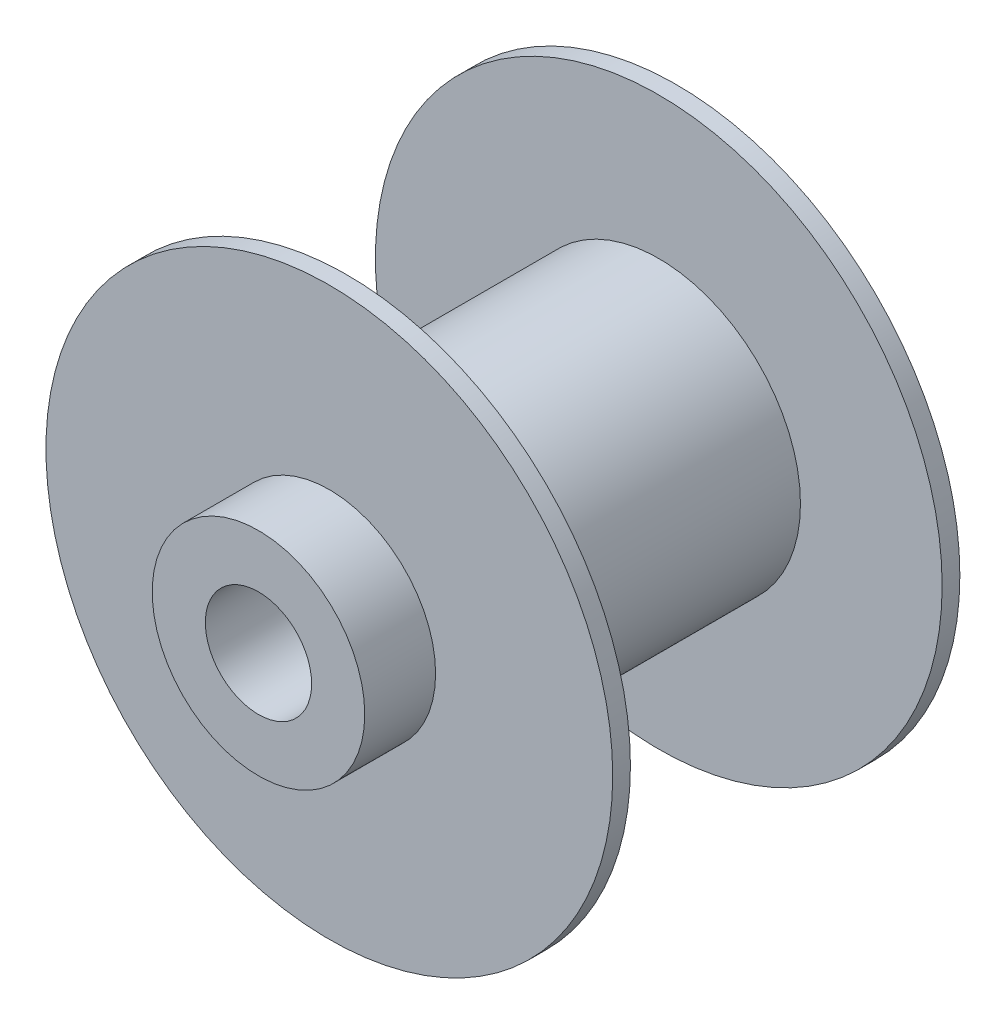
ISO-10303-21;
HEADER;
FILE_DESCRIPTION(('STEP AP214'),'2;1');
FILE_NAME('part.step','',(''),(''),'','','');
FILE_SCHEMA(('AUTOMOTIVE_DESIGN { 1 0 10303 214 1 1 1 1 }'));
ENDSEC;
DATA;
#1=APPLICATION_CONTEXT('core data for automotive mechanical design processes');
#2=APPLICATION_PROTOCOL_DEFINITION('international standard','automotive_design',2000,#1);
#3=PRODUCT_CONTEXT('',#1,'mechanical');
#4=PRODUCT('Part','Part','',(#3));
#5=PRODUCT_RELATED_PRODUCT_CATEGORY('part','',(#4));
#6=PRODUCT_DEFINITION_FORMATION('','',#4);
#7=PRODUCT_DEFINITION_CONTEXT('part definition',#1,'design');
#8=PRODUCT_DEFINITION('design','',#6,#7);
#9=PRODUCT_DEFINITION_SHAPE('','',#8);
#10=(LENGTH_UNIT() NAMED_UNIT(*) SI_UNIT(.MILLI.,.METRE.));
#11=(NAMED_UNIT(*) PLANE_ANGLE_UNIT() SI_UNIT($,.RADIAN.));
#12=(NAMED_UNIT(*) SI_UNIT($,.STERADIAN.) SOLID_ANGLE_UNIT());
#13=UNCERTAINTY_MEASURE_WITH_UNIT(LENGTH_MEASURE(1.E-05),#10,'distance_accuracy_value','');
#14=(GEOMETRIC_REPRESENTATION_CONTEXT(3) GLOBAL_UNCERTAINTY_ASSIGNED_CONTEXT((#13)) GLOBAL_UNIT_ASSIGNED_CONTEXT((#10,
#11,#12)) REPRESENTATION_CONTEXT('',''));
#15=CARTESIAN_POINT('',(0.,0.,0.));
#16=DIRECTION('',(0.,0.,1.));
#17=DIRECTION('',(1.,0.,0.));
#18=AXIS2_PLACEMENT_3D('',#15,#16,#17);
#19=CARTESIAN_POINT('',(0.,0.,3.175));
#20=DIRECTION('',(0.,0.,-1.));
#21=DIRECTION('',(-1.,0.,0.));
#22=AXIS2_PLACEMENT_3D('',#19,#20,#21);
#23=CYLINDRICAL_SURFACE('',#22,50.8);
#24=CARTESIAN_POINT('',(0.,0.,3.175));
#25=DIRECTION('',(0.,0.,1.));
#26=DIRECTION('',(1.,0.,0.));
#27=AXIS2_PLACEMENT_3D('',#24,#25,#26);
#28=CIRCLE('',#27,50.8);
#29=CARTESIAN_POINT('',(50.8,0.,3.175));
#30=VERTEX_POINT('',#29);
#31=EDGE_CURVE('E56',#30,#30,#28,.T.);
#32=ORIENTED_EDGE('',*,*,#31,.F.);
#33=EDGE_LOOP('',(#32));
#34=FACE_BOUND('',#33,.T.);
#35=CARTESIAN_POINT('',(0.,0.,0.));
#36=DIRECTION('',(0.,0.,1.));
#37=DIRECTION('',(1.,0.,0.));
#38=AXIS2_PLACEMENT_3D('',#35,#36,#37);
#39=CIRCLE('',#38,50.8);
#40=CARTESIAN_POINT('',(50.8,0.,0.));
#41=VERTEX_POINT('',#40);
#42=EDGE_CURVE('E47',#41,#41,#39,.T.);
#43=ORIENTED_EDGE('',*,*,#42,.T.);
#44=EDGE_LOOP('',(#43));
#45=FACE_BOUND('',#44,.T.);
#46=ADVANCED_FACE('F44',(#34,#45),#23,.T.);
#47=CARTESIAN_POINT('',(0.,0.,3.175));
#48=DIRECTION('',(0.,0.,1.));
#49=DIRECTION('',(1.,0.,0.));
#50=AXIS2_PLACEMENT_3D('',#47,#48,#49);
#51=PLANE('',#50);
#52=CARTESIAN_POINT('',(0.,0.,3.175));
#53=DIRECTION('',(0.,0.,1.));
#54=DIRECTION('',(1.,0.,0.));
#55=AXIS2_PLACEMENT_3D('',#52,#53,#54);
#56=CIRCLE('',#55,25.4);
#57=CARTESIAN_POINT('',(25.4,0.,3.175));
#58=VERTEX_POINT('',#57);
#59=EDGE_CURVE('E74',#58,#58,#56,.F.);
#60=ORIENTED_EDGE('',*,*,#59,.T.);
#61=EDGE_LOOP('',(#60));
#62=FACE_BOUND('',#61,.T.);
#63=ORIENTED_EDGE('',*,*,#31,.T.);
#64=EDGE_LOOP('',(#63));
#65=FACE_BOUND('',#64,.T.);
#66=ADVANCED_FACE('F86',(#62,#65),#51,.T.);
#67=CARTESIAN_POINT('',(0.,0.,0.));
#68=DIRECTION('',(0.,0.,1.));
#69=DIRECTION('',(1.,0.,0.));
#70=AXIS2_PLACEMENT_3D('',#67,#68,#69);
#71=PLANE('',#70);
#72=CARTESIAN_POINT('',(0.,0.,0.));
#73=DIRECTION('',(0.,0.,-1.));
#74=DIRECTION('',(-1.,0.,0.));
#75=AXIS2_PLACEMENT_3D('',#72,#73,#74);
#76=CIRCLE('',#75,19.05);
#77=CARTESIAN_POINT('',(-19.05,0.,0.));
#78=VERTEX_POINT('',#77);
#79=EDGE_CURVE('E12',#78,#78,#76,.T.);
#80=ORIENTED_EDGE('',*,*,#79,.F.);
#81=EDGE_LOOP('',(#80));
#82=FACE_BOUND('',#81,.T.);
#83=ORIENTED_EDGE('',*,*,#42,.F.);
#84=EDGE_LOOP('',(#83));
#85=FACE_BOUND('',#84,.T.);
#86=ADVANCED_FACE('F83',(#82,#85),#71,.F.);
#87=CARTESIAN_POINT('',(0.,0.,59.055));
#88=DIRECTION('',(0.,0.,-1.));
#89=DIRECTION('',(-1.,0.,0.));
#90=AXIS2_PLACEMENT_3D('',#87,#88,#89);
#91=CYLINDRICAL_SURFACE('',#90,25.4);
#92=ORIENTED_EDGE('',*,*,#59,.F.);
#93=EDGE_LOOP('',(#92));
#94=FACE_BOUND('',#93,.T.);
#95=CARTESIAN_POINT('',(0.,0.,59.055));
#96=DIRECTION('',(0.,0.,1.));
#97=DIRECTION('',(1.,0.,0.));
#98=AXIS2_PLACEMENT_3D('',#95,#96,#97);
#99=CIRCLE('',#98,25.4);
#100=CARTESIAN_POINT('',(25.4,0.,59.055));
#101=VERTEX_POINT('',#100);
#102=EDGE_CURVE('E69',#101,#101,#99,.T.);
#103=ORIENTED_EDGE('',*,*,#102,.F.);
#104=EDGE_LOOP('',(#103));
#105=FACE_BOUND('',#104,.T.);
#106=ADVANCED_FACE('F85',(#94,#105),#91,.T.);
#107=CARTESIAN_POINT('',(0.,0.,62.23));
#108=DIRECTION('',(0.,0.,-1.));
#109=DIRECTION('',(-1.,0.,0.));
#110=AXIS2_PLACEMENT_3D('',#107,#108,#109);
#111=CYLINDRICAL_SURFACE('',#110,50.8);
#112=CARTESIAN_POINT('',(0.,0.,62.23));
#113=DIRECTION('',(0.,0.,1.));
#114=DIRECTION('',(1.,0.,0.));
#115=AXIS2_PLACEMENT_3D('',#112,#113,#114);
#116=CIRCLE('',#115,50.8);
#117=CARTESIAN_POINT('',(50.8,0.,62.23));
#118=VERTEX_POINT('',#117);
#119=EDGE_CURVE('E66',#118,#118,#116,.T.);
#120=ORIENTED_EDGE('',*,*,#119,.F.);
#121=EDGE_LOOP('',(#120));
#122=FACE_BOUND('',#121,.T.);
#123=CARTESIAN_POINT('',(0.,0.,59.055));
#124=DIRECTION('',(0.,0.,1.));
#125=DIRECTION('',(1.,0.,0.));
#126=AXIS2_PLACEMENT_3D('',#123,#124,#125);
#127=CIRCLE('',#126,50.8);
#128=CARTESIAN_POINT('',(50.8,0.,59.055));
#129=VERTEX_POINT('',#128);
#130=EDGE_CURVE('E64',#129,#129,#127,.T.);
#131=ORIENTED_EDGE('',*,*,#130,.T.);
#132=EDGE_LOOP('',(#131));
#133=FACE_BOUND('',#132,.T.);
#134=ADVANCED_FACE('F92',(#122,#133),#111,.T.);
#135=CARTESIAN_POINT('',(0.,0.,62.23));
#136=DIRECTION('',(0.,0.,1.));
#137=DIRECTION('',(1.,0.,0.));
#138=AXIS2_PLACEMENT_3D('',#135,#136,#137);
#139=PLANE('',#138);
#140=CARTESIAN_POINT('',(0.,0.,62.23));
#141=DIRECTION('',(0.,0.,1.));
#142=DIRECTION('',(1.,0.,0.));
#143=AXIS2_PLACEMENT_3D('',#140,#141,#142);
#144=CIRCLE('',#143,19.05);
#145=CARTESIAN_POINT('',(19.05,0.,62.23));
#146=VERTEX_POINT('',#145);
#147=EDGE_CURVE('E51',#146,#146,#144,.T.);
#148=ORIENTED_EDGE('',*,*,#147,.F.);
#149=EDGE_LOOP('',(#148));
#150=FACE_BOUND('',#149,.T.);
#151=ORIENTED_EDGE('',*,*,#119,.T.);
#152=EDGE_LOOP('',(#151));
#153=FACE_BOUND('',#152,.T.);
#154=ADVANCED_FACE('F121',(#150,#153),#139,.T.);
#155=CARTESIAN_POINT('',(0.,0.,59.055));
#156=DIRECTION('',(0.,0.,1.));
#157=DIRECTION('',(1.,0.,0.));
#158=AXIS2_PLACEMENT_3D('',#155,#156,#157);
#159=PLANE('',#158);
#160=ORIENTED_EDGE('',*,*,#102,.T.);
#161=EDGE_LOOP('',(#160));
#162=FACE_BOUND('',#161,.T.);
#163=ORIENTED_EDGE('',*,*,#130,.F.);
#164=EDGE_LOOP('',(#163));
#165=FACE_BOUND('',#164,.T.);
#166=ADVANCED_FACE('F129',(#162,#165),#159,.F.);
#167=CARTESIAN_POINT('',(0.,0.,74.93));
#168=DIRECTION('',(0.,0.,-1.));
#169=DIRECTION('',(-1.,0.,0.));
#170=AXIS2_PLACEMENT_3D('',#167,#168,#169);
#171=CYLINDRICAL_SURFACE('',#170,19.05);
#172=CARTESIAN_POINT('',(0.,0.,74.93));
#173=DIRECTION('',(0.,0.,1.));
#174=DIRECTION('',(1.,0.,0.));
#175=AXIS2_PLACEMENT_3D('',#172,#173,#174);
#176=CIRCLE('',#175,19.05);
#177=CARTESIAN_POINT('',(19.05,0.,74.93));
#178=VERTEX_POINT('',#177);
#179=EDGE_CURVE('E62',#178,#178,#176,.T.);
#180=ORIENTED_EDGE('',*,*,#179,.F.);
#181=EDGE_LOOP('',(#180));
#182=FACE_BOUND('',#181,.T.);
#183=ORIENTED_EDGE('',*,*,#147,.T.);
#184=EDGE_LOOP('',(#183));
#185=FACE_BOUND('',#184,.T.);
#186=ADVANCED_FACE('F134',(#182,#185),#171,.T.);
#187=CARTESIAN_POINT('',(0.,0.,74.93));
#188=DIRECTION('',(0.,0.,1.));
#189=DIRECTION('',(1.,0.,0.));
#190=AXIS2_PLACEMENT_3D('',#187,#188,#189);
#191=PLANE('',#190);
#192=CARTESIAN_POINT('',(0.,0.,74.93));
#193=DIRECTION('',(0.,0.,1.));
#194=DIRECTION('',(1.,0.,0.));
#195=AXIS2_PLACEMENT_3D('',#192,#193,#194);
#196=CIRCLE('',#195,9.525);
#197=CARTESIAN_POINT('',(9.525,0.,74.93));
#198=VERTEX_POINT('',#197);
#199=EDGE_CURVE('E204',#198,#198,#196,.T.);
#200=ORIENTED_EDGE('',*,*,#199,.F.);
#201=EDGE_LOOP('',(#200));
#202=FACE_BOUND('',#201,.T.);
#203=ORIENTED_EDGE('',*,*,#179,.T.);
#204=EDGE_LOOP('',(#203));
#205=FACE_BOUND('',#204,.T.);
#206=ADVANCED_FACE('F150',(#202,#205),#191,.T.);
#207=CARTESIAN_POINT('',(0.,0.,-12.7));
#208=DIRECTION('',(0.,0.,1.));
#209=DIRECTION('',(1.,0.,0.));
#210=AXIS2_PLACEMENT_3D('',#207,#208,#209);
#211=CYLINDRICAL_SURFACE('',#210,19.05);
#212=CARTESIAN_POINT('',(0.,0.,-12.7));
#213=DIRECTION('',(0.,0.,-1.));
#214=DIRECTION('',(-1.,0.,0.));
#215=AXIS2_PLACEMENT_3D('',#212,#213,#214);
#216=CIRCLE('',#215,19.05);
#217=CARTESIAN_POINT('',(-19.05,0.,-12.7));
#218=VERTEX_POINT('',#217);
#219=EDGE_CURVE('E60',#218,#218,#216,.T.);
#220=ORIENTED_EDGE('',*,*,#219,.F.);
#221=EDGE_LOOP('',(#220));
#222=FACE_BOUND('',#221,.T.);
#223=ORIENTED_EDGE('',*,*,#79,.T.);
#224=EDGE_LOOP('',(#223));
#225=FACE_BOUND('',#224,.T.);
#226=ADVANCED_FACE('F162',(#222,#225),#211,.T.);
#227=CARTESIAN_POINT('',(0.,0.,-12.7));
#228=DIRECTION('',(0.,0.,-1.));
#229=DIRECTION('',(-1.,0.,0.));
#230=AXIS2_PLACEMENT_3D('',#227,#228,#229);
#231=PLANE('',#230);
#232=CARTESIAN_POINT('',(0.,0.,-12.7));
#233=DIRECTION('',(0.,0.,1.));
#234=DIRECTION('',(1.,0.,0.));
#235=AXIS2_PLACEMENT_3D('',#232,#233,#234);
#236=CIRCLE('',#235,9.525);
#237=CARTESIAN_POINT('',(9.525,0.,-12.7));
#238=VERTEX_POINT('',#237);
#239=EDGE_CURVE('E201',#238,#238,#236,.T.);
#240=ORIENTED_EDGE('',*,*,#239,.T.);
#241=EDGE_LOOP('',(#240));
#242=FACE_BOUND('',#241,.T.);
#243=ORIENTED_EDGE('',*,*,#219,.T.);
#244=EDGE_LOOP('',(#243));
#245=FACE_BOUND('',#244,.T.);
#246=ADVANCED_FACE('F167',(#242,#245),#231,.T.);
#247=CARTESIAN_POINT('',(0.,0.,-12.7));
#248=DIRECTION('',(0.,0.,1.));
#249=DIRECTION('',(1.,0.,0.));
#250=AXIS2_PLACEMENT_3D('',#247,#248,#249);
#251=CYLINDRICAL_SURFACE('',#250,9.525);
#252=ORIENTED_EDGE('',*,*,#239,.F.);
#253=EDGE_LOOP('',(#252));
#254=FACE_BOUND('',#253,.T.);
#255=ORIENTED_EDGE('',*,*,#199,.T.);
#256=EDGE_LOOP('',(#255));
#257=FACE_BOUND('',#256,.T.);
#258=ADVANCED_FACE('F184',(#254,#257),#251,.F.);
#259=CLOSED_SHELL('',(#46,#66,#86,#106,#134,#154,#166,#186,#206,#226,#246,#258));
#260=MANIFOLD_SOLID_BREP('B2',#259);
#261=ADVANCED_BREP_SHAPE_REPRESENTATION('',(#18,#260),#14);
#262=SHAPE_DEFINITION_REPRESENTATION(#9,#261);
ENDSEC;
END-ISO-10303-21;
